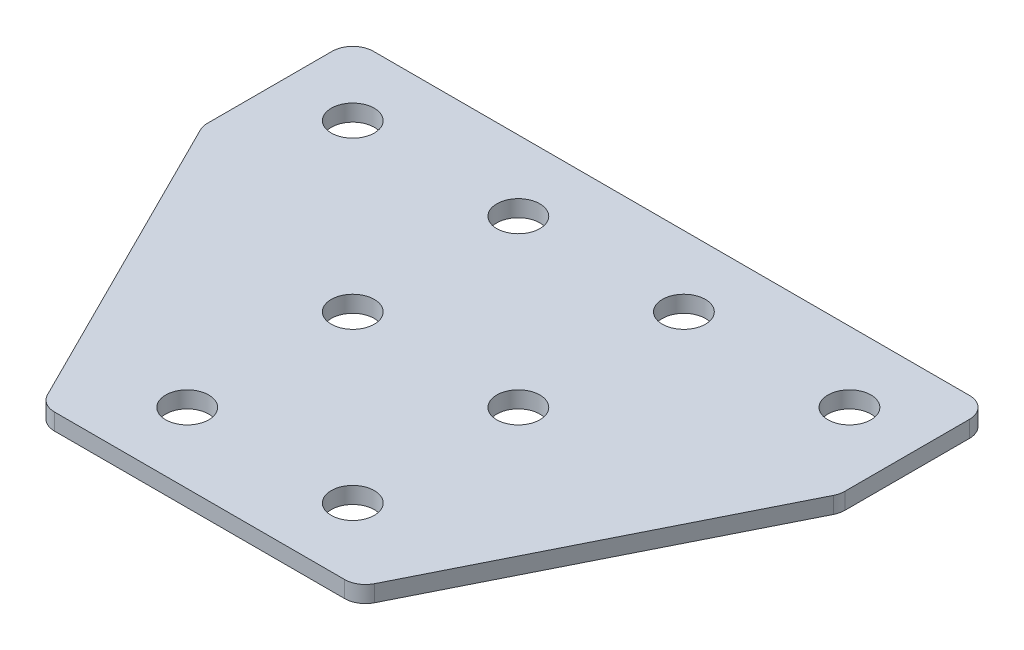
ISO-10303-21;
HEADER;
FILE_DESCRIPTION(('STEP AP214'),'2;1');
FILE_NAME('part.step','',(''),(''),'','','');
FILE_SCHEMA(('AUTOMOTIVE_DESIGN { 1 0 10303 214 1 1 1 1 }'));
ENDSEC;
DATA;
#1=APPLICATION_CONTEXT('core data for automotive mechanical design processes');
#2=APPLICATION_PROTOCOL_DEFINITION('international standard','automotive_design',2000,#1);
#3=PRODUCT_CONTEXT('',#1,'mechanical');
#4=PRODUCT('Part','Part','',(#3));
#5=PRODUCT_RELATED_PRODUCT_CATEGORY('part','',(#4));
#6=PRODUCT_DEFINITION_FORMATION('','',#4);
#7=PRODUCT_DEFINITION_CONTEXT('part definition',#1,'design');
#8=PRODUCT_DEFINITION('design','',#6,#7);
#9=PRODUCT_DEFINITION_SHAPE('','',#8);
#10=(LENGTH_UNIT() NAMED_UNIT(*) SI_UNIT(.MILLI.,.METRE.));
#11=(NAMED_UNIT(*) PLANE_ANGLE_UNIT() SI_UNIT($,.RADIAN.));
#12=(NAMED_UNIT(*) SI_UNIT($,.STERADIAN.) SOLID_ANGLE_UNIT());
#13=UNCERTAINTY_MEASURE_WITH_UNIT(LENGTH_MEASURE(1.E-05),#10,'distance_accuracy_value','');
#14=(GEOMETRIC_REPRESENTATION_CONTEXT(3) GLOBAL_UNCERTAINTY_ASSIGNED_CONTEXT((#13)) GLOBAL_UNIT_ASSIGNED_CONTEXT((#10,
#11,#12)) REPRESENTATION_CONTEXT('',''));
#15=CARTESIAN_POINT('',(0.,0.,0.));
#16=DIRECTION('',(0.,0.,1.));
#17=DIRECTION('',(1.,0.,0.));
#18=AXIS2_PLACEMENT_3D('',#15,#16,#17);
#19=CARTESIAN_POINT('',(-1.45351271942218,1.70798729377475,-21.2540344861804));
#20=DIRECTION('',(0.,-1.,0.));
#21=DIRECTION('',(0.,0.,-1.));
#22=AXIS2_PLACEMENT_3D('',#19,#20,#21);
#23=PLANE('',#22);
#24=DIRECTION('',(1.,0.,0.));
#25=VECTOR('',#24,1.);
#26=CARTESIAN_POINT('',(-19.9535127194222,1.70798729377475,27.2459655138196));
#27=LINE('',#26,#25);
#28=CARTESIAN_POINT('',(-18.9813767644227,1.70798729377475,27.2459655138196));
#29=VERTEX_POINT('',#28);
#30=CARTESIAN_POINT('',(16.0743513255783,1.70798729377475,27.2459655138196));
#31=VERTEX_POINT('',#30);
#32=EDGE_CURVE('E194',#29,#31,#27,.T.);
#33=ORIENTED_EDGE('',*,*,#32,.F.);
#34=CARTESIAN_POINT('',(-18.9813767644227,1.70798729377475,24.7459655138196));
#35=DIRECTION('',(0.,1.,0.));
#36=DIRECTION('',(0.,0.,-1.));
#37=AXIS2_PLACEMENT_3D('',#34,#35,#36);
#38=CIRCLE('',#37,2.5);
#39=CARTESIAN_POINT('',(-21.2174447419224,1.70798729377475,25.8639995025694));
#40=VERTEX_POINT('',#39);
#41=EDGE_CURVE('E154',#40,#29,#38,.T.);
#42=ORIENTED_EDGE('',*,*,#41,.F.);
#43=DIRECTION('',(-0.447213595499957,0.,-0.894427190999917));
#44=VECTOR('',#43,1.);
#45=CARTESIAN_POINT('',(-20.5264617362974,1.70798729377475,27.2459655138196));
#46=LINE('',#45,#44);
#47=CARTESIAN_POINT('',(-39.6895806969219,1.70798729377475,-11.0802724074296));
#48=VERTEX_POINT('',#47);
#49=EDGE_CURVE('E141',#40,#48,#46,.T.);
#50=ORIENTED_EDGE('',*,*,#49,.T.);
#51=CARTESIAN_POINT('',(-37.4535127194221,1.70798729377475,-12.1983063961795));
#52=DIRECTION('',(0.,1.,0.));
#53=DIRECTION('',(0.,0.,-1.));
#54=AXIS2_PLACEMENT_3D('',#51,#52,#53);
#55=CIRCLE('',#54,2.5);
#56=CARTESIAN_POINT('',(-39.9535127194221,1.70798729377475,-12.1983063961795));
#57=VERTEX_POINT('',#56);
#58=EDGE_CURVE('E152',#57,#48,#55,.T.);
#59=ORIENTED_EDGE('',*,*,#58,.F.);
#60=DIRECTION('',(0.,0.,-1.));
#61=VECTOR('',#60,1.);
#62=CARTESIAN_POINT('',(-39.9535127194221,1.70798729377475,-11.60813645243));
#63=LINE('',#62,#61);
#64=CARTESIAN_POINT('',(-39.9535127194221,1.70798729377475,-27.2540344861804));
#65=VERTEX_POINT('',#64);
#66=EDGE_CURVE('E124',#57,#65,#63,.T.);
#67=ORIENTED_EDGE('',*,*,#66,.T.);
#68=CARTESIAN_POINT('',(-37.4535127194221,1.70798729377475,-27.2540344861804));
#69=DIRECTION('',(0.,1.,0.));
#70=DIRECTION('',(0.,0.,-1.));
#71=AXIS2_PLACEMENT_3D('',#68,#69,#70);
#72=CIRCLE('',#71,2.5);
#73=CARTESIAN_POINT('',(-37.4535127194221,1.70798729377475,-29.7540344861804));
#74=VERTEX_POINT('',#73);
#75=EDGE_CURVE('E149',#74,#65,#72,.T.);
#76=ORIENTED_EDGE('',*,*,#75,.F.);
#77=DIRECTION('',(-1.,0.,0.));
#78=VECTOR('',#77,1.);
#79=CARTESIAN_POINT('',(37.0464872805778,1.70798729377475,-29.7540344861805));
#80=LINE('',#79,#78);
#81=CARTESIAN_POINT('',(34.5464872805778,1.70798729377475,-29.7540344861805));
#82=VERTEX_POINT('',#81);
#83=EDGE_CURVE('E191',#82,#74,#80,.T.);
#84=ORIENTED_EDGE('',*,*,#83,.F.);
#85=CARTESIAN_POINT('',(34.5464872805778,1.70798729377475,-27.2540344861805));
#86=DIRECTION('',(0.,-1.,0.));
#87=DIRECTION('',(0.,0.,-1.));
#88=AXIS2_PLACEMENT_3D('',#85,#86,#87);
#89=CIRCLE('',#88,2.5);
#90=CARTESIAN_POINT('',(37.0464872805778,1.70798729377475,-27.2540344861805));
#91=VERTEX_POINT('',#90);
#92=EDGE_CURVE('E215',#82,#91,#89,.T.);
#93=ORIENTED_EDGE('',*,*,#92,.T.);
#94=DIRECTION('',(0.,0.,-1.));
#95=VECTOR('',#94,1.);
#96=CARTESIAN_POINT('',(37.0464872805778,1.70798729377475,-11.60813645243));
#97=LINE('',#96,#95);
#98=CARTESIAN_POINT('',(37.0464872805778,1.70798729377475,-12.1983063961795));
#99=VERTEX_POINT('',#98);
#100=EDGE_CURVE('E188',#99,#91,#97,.T.);
#101=ORIENTED_EDGE('',*,*,#100,.F.);
#102=CARTESIAN_POINT('',(34.5464872805778,1.70798729377475,-12.1983063961795));
#103=DIRECTION('',(0.,-1.,0.));
#104=DIRECTION('',(0.,0.,-1.));
#105=AXIS2_PLACEMENT_3D('',#102,#103,#104);
#106=CIRCLE('',#105,2.5);
#107=CARTESIAN_POINT('',(36.7825552580775,1.70798729377475,-11.0802724074296));
#108=VERTEX_POINT('',#107);
#109=EDGE_CURVE('E31',#99,#108,#106,.T.);
#110=ORIENTED_EDGE('',*,*,#109,.T.);
#111=DIRECTION('',(0.447213595499956,0.,-0.894427190999917));
#112=VECTOR('',#111,1.);
#113=CARTESIAN_POINT('',(17.619436297453,1.70798729377475,27.2459655138196));
#114=LINE('',#113,#112);
#115=CARTESIAN_POINT('',(18.3104193030781,1.70798729377475,25.8639995025694));
#116=VERTEX_POINT('',#115);
#117=EDGE_CURVE('E196',#116,#108,#114,.T.);
#118=ORIENTED_EDGE('',*,*,#117,.F.);
#119=CARTESIAN_POINT('',(16.0743513255783,1.70798729377475,24.7459655138196));
#120=DIRECTION('',(0.,-1.,0.));
#121=DIRECTION('',(0.,0.,-1.));
#122=AXIS2_PLACEMENT_3D('',#119,#120,#121);
#123=CIRCLE('',#122,2.5);
#124=EDGE_CURVE('E218',#116,#31,#123,.T.);
#125=ORIENTED_EDGE('',*,*,#124,.T.);
#126=EDGE_LOOP('',(#33,#42,#50,#59,#67,#76,#84,#93,#101,#110,#118,#125));
#127=FACE_BOUND('',#126,.T.);
#128=CARTESIAN_POINT('',(8.54648728057783,1.70798729377475,18.7459655138196));
#129=DIRECTION('',(0.,1.,0.));
#130=DIRECTION('',(0.,0.,1.));
#131=AXIS2_PLACEMENT_3D('',#128,#129,#130);
#132=CIRCLE('',#131,2.6);
#133=CARTESIAN_POINT('',(8.54648728057783,1.70798729377475,21.3459655138196));
#134=VERTEX_POINT('',#133);
#135=EDGE_CURVE('E164',#134,#134,#132,.T.);
#136=ORIENTED_EDGE('',*,*,#135,.T.);
#137=EDGE_LOOP('',(#136));
#138=FACE_BOUND('',#137,.T.);
#139=CARTESIAN_POINT('',(8.54648728057783,1.70798729377475,-1.2540344861804));
#140=DIRECTION('',(0.,1.,0.));
#141=DIRECTION('',(0.,0.,1.));
#142=AXIS2_PLACEMENT_3D('',#139,#140,#141);
#143=CIRCLE('',#142,2.6);
#144=CARTESIAN_POINT('',(8.54648728057783,1.70798729377475,1.3459655138196));
#145=VERTEX_POINT('',#144);
#146=EDGE_CURVE('E170',#145,#145,#143,.T.);
#147=ORIENTED_EDGE('',*,*,#146,.T.);
#148=EDGE_LOOP('',(#147));
#149=FACE_BOUND('',#148,.T.);
#150=CARTESIAN_POINT('',(28.5464872805778,1.70798729377475,-21.2540344861804));
#151=DIRECTION('',(0.,1.,0.));
#152=DIRECTION('',(0.,0.,1.));
#153=AXIS2_PLACEMENT_3D('',#150,#151,#152);
#154=CIRCLE('',#153,2.6);
#155=CARTESIAN_POINT('',(28.5464872805778,1.70798729377475,-18.6540344861804));
#156=VERTEX_POINT('',#155);
#157=EDGE_CURVE('E176',#156,#156,#154,.T.);
#158=ORIENTED_EDGE('',*,*,#157,.T.);
#159=EDGE_LOOP('',(#158));
#160=FACE_BOUND('',#159,.T.);
#161=CARTESIAN_POINT('',(8.54648728057784,1.70798729377475,-21.2540344861804));
#162=DIRECTION('',(0.,1.,0.));
#163=DIRECTION('',(0.,0.,1.));
#164=AXIS2_PLACEMENT_3D('',#161,#162,#163);
#165=CIRCLE('',#164,2.6);
#166=CARTESIAN_POINT('',(8.54648728057784,1.70798729377475,-18.6540344861804));
#167=VERTEX_POINT('',#166);
#168=EDGE_CURVE('E182',#167,#167,#165,.T.);
#169=ORIENTED_EDGE('',*,*,#168,.T.);
#170=EDGE_LOOP('',(#169));
#171=FACE_BOUND('',#170,.T.);
#172=CARTESIAN_POINT('',(-11.4535127194222,1.70798729377475,18.7459655138196));
#173=DIRECTION('',(0.,-1.,0.));
#174=DIRECTION('',(0.,0.,1.));
#175=AXIS2_PLACEMENT_3D('',#172,#173,#174);
#176=CIRCLE('',#175,2.6);
#177=CARTESIAN_POINT('',(-11.4535127194222,1.70798729377475,21.3459655138196));
#178=VERTEX_POINT('',#177);
#179=EDGE_CURVE('E270',#178,#178,#176,.T.);
#180=ORIENTED_EDGE('',*,*,#179,.F.);
#181=EDGE_LOOP('',(#180));
#182=FACE_BOUND('',#181,.T.);
#183=CARTESIAN_POINT('',(-11.4535127194222,1.70798729377475,-1.2540344861804));
#184=DIRECTION('',(0.,-1.,0.));
#185=DIRECTION('',(0.,0.,1.));
#186=AXIS2_PLACEMENT_3D('',#183,#184,#185);
#187=CIRCLE('',#186,2.6);
#188=CARTESIAN_POINT('',(-11.4535127194222,1.70798729377475,1.3459655138196));
#189=VERTEX_POINT('',#188);
#190=EDGE_CURVE('E264',#189,#189,#187,.T.);
#191=ORIENTED_EDGE('',*,*,#190,.F.);
#192=EDGE_LOOP('',(#191));
#193=FACE_BOUND('',#192,.T.);
#194=CARTESIAN_POINT('',(-31.4535127194222,1.70798729377475,-21.2540344861804));
#195=DIRECTION('',(0.,-1.,0.));
#196=DIRECTION('',(0.,0.,1.));
#197=AXIS2_PLACEMENT_3D('',#194,#195,#196);
#198=CIRCLE('',#197,2.6);
#199=CARTESIAN_POINT('',(-31.4535127194222,1.70798729377475,-18.6540344861804));
#200=VERTEX_POINT('',#199);
#201=EDGE_CURVE('E259',#200,#200,#198,.T.);
#202=ORIENTED_EDGE('',*,*,#201,.F.);
#203=EDGE_LOOP('',(#202));
#204=FACE_BOUND('',#203,.T.);
#205=CARTESIAN_POINT('',(-11.4535127194222,1.70798729377475,-21.2540344861804));
#206=DIRECTION('',(0.,-1.,0.));
#207=DIRECTION('',(0.,0.,1.));
#208=AXIS2_PLACEMENT_3D('',#205,#206,#207);
#209=CIRCLE('',#208,2.6);
#210=CARTESIAN_POINT('',(-11.4535127194222,1.70798729377475,-18.6540344861804));
#211=VERTEX_POINT('',#210);
#212=EDGE_CURVE('E134',#211,#211,#209,.T.);
#213=ORIENTED_EDGE('',*,*,#212,.F.);
#214=EDGE_LOOP('',(#213));
#215=FACE_BOUND('',#214,.T.);
#216=ADVANCED_FACE('F16',(#127,#138,#149,#160,#171,#182,#193,#204,#215),#23,.T.);
#217=CARTESIAN_POINT('',(37.0464872805778,1.70798729377475,-11.60813645243));
#218=DIRECTION('',(1.,0.,0.));
#219=DIRECTION('',(0.,0.,-1.));
#220=AXIS2_PLACEMENT_3D('',#217,#218,#219);
#221=PLANE('',#220);
#222=DIRECTION('',(0.,0.,-1.));
#223=VECTOR('',#222,1.);
#224=CARTESIAN_POINT('',(37.0464872805778,3.70798729377475,-11.60813645243));
#225=LINE('',#224,#223);
#226=CARTESIAN_POINT('',(37.0464872805778,3.70798729377475,-12.1983063961795));
#227=VERTEX_POINT('',#226);
#228=CARTESIAN_POINT('',(37.0464872805778,3.70798729377475,-27.2540344861805));
#229=VERTEX_POINT('',#228);
#230=EDGE_CURVE('E185',#227,#229,#225,.T.);
#231=ORIENTED_EDGE('',*,*,#230,.F.);
#232=DIRECTION('',(0.,1.,0.));
#233=VECTOR('',#232,1.);
#234=CARTESIAN_POINT('',(37.0464872805778,1.70798729377475,-12.1983063961795));
#235=LINE('',#234,#233);
#236=EDGE_CURVE('E24',#227,#99,#235,.F.);
#237=ORIENTED_EDGE('',*,*,#236,.T.);
#238=ORIENTED_EDGE('',*,*,#100,.T.);
#239=DIRECTION('',(0.,1.,0.));
#240=VECTOR('',#239,1.);
#241=CARTESIAN_POINT('',(37.0464872805778,1.70798729377475,-27.2540344861805));
#242=LINE('',#241,#240);
#243=EDGE_CURVE('E225',#91,#229,#242,.T.);
#244=ORIENTED_EDGE('',*,*,#243,.T.);
#245=EDGE_LOOP('',(#231,#237,#238,#244));
#246=FACE_BOUND('',#245,.T.);
#247=ADVANCED_FACE('F230',(#246),#221,.T.);
#248=CARTESIAN_POINT('',(17.619436297453,1.70798729377475,27.2459655138196));
#249=DIRECTION('',(0.894427190999917,0.,0.447213595499956));
#250=DIRECTION('',(0.447213595499956,0.,-0.894427190999917));
#251=AXIS2_PLACEMENT_3D('',#248,#249,#250);
#252=PLANE('',#251);
#253=DIRECTION('',(0.447213595499956,0.,-0.894427190999917));
#254=VECTOR('',#253,1.);
#255=CARTESIAN_POINT('',(17.619436297453,3.70798729377475,27.2459655138196));
#256=LINE('',#255,#254);
#257=CARTESIAN_POINT('',(18.3104193030781,3.70798729377475,25.8639995025694));
#258=VERTEX_POINT('',#257);
#259=CARTESIAN_POINT('',(36.7825552580775,3.70798729377475,-11.0802724074296));
#260=VERTEX_POINT('',#259);
#261=EDGE_CURVE('E192',#258,#260,#256,.T.);
#262=ORIENTED_EDGE('',*,*,#261,.F.);
#263=DIRECTION('',(0.,1.,0.));
#264=VECTOR('',#263,1.);
#265=CARTESIAN_POINT('',(18.3104193030781,1.70798729377475,25.8639995025694));
#266=LINE('',#265,#264);
#267=EDGE_CURVE('E38',#258,#116,#266,.F.);
#268=ORIENTED_EDGE('',*,*,#267,.T.);
#269=ORIENTED_EDGE('',*,*,#117,.T.);
#270=DIRECTION('',(0.,1.,0.));
#271=VECTOR('',#270,1.);
#272=CARTESIAN_POINT('',(36.7825552580775,1.70798729377475,-11.0802724074296));
#273=LINE('',#272,#271);
#274=EDGE_CURVE('E221',#108,#260,#273,.T.);
#275=ORIENTED_EDGE('',*,*,#274,.T.);
#276=EDGE_LOOP('',(#262,#268,#269,#275));
#277=FACE_BOUND('',#276,.T.);
#278=ADVANCED_FACE('F238',(#277),#252,.T.);
#279=CARTESIAN_POINT('',(-19.9535127194222,1.70798729377475,27.2459655138196));
#280=DIRECTION('',(0.,0.,1.));
#281=DIRECTION('',(1.,0.,0.));
#282=AXIS2_PLACEMENT_3D('',#279,#280,#281);
#283=PLANE('',#282);
#284=DIRECTION('',(1.,0.,0.));
#285=VECTOR('',#284,1.);
#286=CARTESIAN_POINT('',(-19.9535127194222,3.70798729377475,27.2459655138196));
#287=LINE('',#286,#285);
#288=CARTESIAN_POINT('',(-18.9813767644227,3.70798729377475,27.2459655138196));
#289=VERTEX_POINT('',#288);
#290=CARTESIAN_POINT('',(16.0743513255783,3.70798729377475,27.2459655138196));
#291=VERTEX_POINT('',#290);
#292=EDGE_CURVE('E203',#289,#291,#287,.T.);
#293=ORIENTED_EDGE('',*,*,#292,.F.);
#294=DIRECTION('',(0.,1.,0.));
#295=VECTOR('',#294,1.);
#296=CARTESIAN_POINT('',(-18.9813767644227,1.70798729377475,27.2459655138196));
#297=LINE('',#296,#295);
#298=EDGE_CURVE('E146',#29,#289,#297,.T.);
#299=ORIENTED_EDGE('',*,*,#298,.F.);
#300=ORIENTED_EDGE('',*,*,#32,.T.);
#301=DIRECTION('',(0.,1.,0.));
#302=VECTOR('',#301,1.);
#303=CARTESIAN_POINT('',(16.0743513255783,1.70798729377475,27.2459655138196));
#304=LINE('',#303,#302);
#305=EDGE_CURVE('E212',#31,#291,#304,.T.);
#306=ORIENTED_EDGE('',*,*,#305,.T.);
#307=EDGE_LOOP('',(#293,#299,#300,#306));
#308=FACE_BOUND('',#307,.T.);
#309=ADVANCED_FACE('F246',(#308),#283,.T.);
#310=CARTESIAN_POINT('',(37.0464872805778,1.70798729377475,-29.7540344861805));
#311=DIRECTION('',(0.,0.,-1.));
#312=DIRECTION('',(-1.,0.,0.));
#313=AXIS2_PLACEMENT_3D('',#310,#311,#312);
#314=PLANE('',#313);
#315=ORIENTED_EDGE('',*,*,#83,.T.);
#316=DIRECTION('',(0.,1.,0.));
#317=VECTOR('',#316,1.);
#318=CARTESIAN_POINT('',(-37.4535127194221,1.70798729377475,-29.7540344861804));
#319=LINE('',#318,#317);
#320=CARTESIAN_POINT('',(-37.4535127194221,3.70798729377475,-29.7540344861804));
#321=VERTEX_POINT('',#320);
#322=EDGE_CURVE('E126',#321,#74,#319,.F.);
#323=ORIENTED_EDGE('',*,*,#322,.F.);
#324=DIRECTION('',(-1.,0.,0.));
#325=VECTOR('',#324,1.);
#326=CARTESIAN_POINT('',(37.0464872805778,3.70798729377475,-29.7540344861805));
#327=LINE('',#326,#325);
#328=CARTESIAN_POINT('',(34.5464872805778,3.70798729377475,-29.7540344861805));
#329=VERTEX_POINT('',#328);
#330=EDGE_CURVE('E201',#329,#321,#327,.T.);
#331=ORIENTED_EDGE('',*,*,#330,.F.);
#332=DIRECTION('',(0.,1.,0.));
#333=VECTOR('',#332,1.);
#334=CARTESIAN_POINT('',(34.5464872805778,1.70798729377475,-29.7540344861805));
#335=LINE('',#334,#333);
#336=EDGE_CURVE('E10',#329,#82,#335,.F.);
#337=ORIENTED_EDGE('',*,*,#336,.T.);
#338=EDGE_LOOP('',(#315,#323,#331,#337));
#339=FACE_BOUND('',#338,.T.);
#340=ADVANCED_FACE('F300',(#339),#314,.T.);
#341=CARTESIAN_POINT('',(-1.45351271942218,3.70798729377475,-21.2540344861804));
#342=DIRECTION('',(0.,-1.,0.));
#343=DIRECTION('',(0.,0.,-1.));
#344=AXIS2_PLACEMENT_3D('',#341,#342,#343);
#345=PLANE('',#344);
#346=CARTESIAN_POINT('',(8.54648728057783,3.70798729377475,18.7459655138196));
#347=DIRECTION('',(0.,1.,0.));
#348=DIRECTION('',(0.,0.,1.));
#349=AXIS2_PLACEMENT_3D('',#346,#347,#348);
#350=CIRCLE('',#349,2.6);
#351=CARTESIAN_POINT('',(8.54648728057783,3.70798729377475,21.3459655138196));
#352=VERTEX_POINT('',#351);
#353=EDGE_CURVE('E163',#352,#352,#350,.T.);
#354=ORIENTED_EDGE('',*,*,#353,.F.);
#355=EDGE_LOOP('',(#354));
#356=FACE_BOUND('',#355,.T.);
#357=CARTESIAN_POINT('',(8.54648728057783,3.70798729377475,-1.2540344861804));
#358=DIRECTION('',(0.,1.,0.));
#359=DIRECTION('',(0.,0.,1.));
#360=AXIS2_PLACEMENT_3D('',#357,#358,#359);
#361=CIRCLE('',#360,2.6);
#362=CARTESIAN_POINT('',(8.54648728057783,3.70798729377475,1.3459655138196));
#363=VERTEX_POINT('',#362);
#364=EDGE_CURVE('E167',#363,#363,#361,.T.);
#365=ORIENTED_EDGE('',*,*,#364,.F.);
#366=EDGE_LOOP('',(#365));
#367=FACE_BOUND('',#366,.T.);
#368=CARTESIAN_POINT('',(28.5464872805778,3.70798729377475,-21.2540344861804));
#369=DIRECTION('',(0.,1.,0.));
#370=DIRECTION('',(0.,0.,1.));
#371=AXIS2_PLACEMENT_3D('',#368,#369,#370);
#372=CIRCLE('',#371,2.6);
#373=CARTESIAN_POINT('',(28.5464872805778,3.70798729377475,-18.6540344861804));
#374=VERTEX_POINT('',#373);
#375=EDGE_CURVE('E173',#374,#374,#372,.T.);
#376=ORIENTED_EDGE('',*,*,#375,.F.);
#377=EDGE_LOOP('',(#376));
#378=FACE_BOUND('',#377,.T.);
#379=CARTESIAN_POINT('',(8.54648728057784,3.70798729377475,-21.2540344861804));
#380=DIRECTION('',(0.,1.,0.));
#381=DIRECTION('',(0.,0.,1.));
#382=AXIS2_PLACEMENT_3D('',#379,#380,#381);
#383=CIRCLE('',#382,2.6);
#384=CARTESIAN_POINT('',(8.54648728057784,3.70798729377475,-18.6540344861804));
#385=VERTEX_POINT('',#384);
#386=EDGE_CURVE('E179',#385,#385,#383,.T.);
#387=ORIENTED_EDGE('',*,*,#386,.F.);
#388=EDGE_LOOP('',(#387));
#389=FACE_BOUND('',#388,.T.);
#390=ORIENTED_EDGE('',*,*,#330,.T.);
#391=CARTESIAN_POINT('',(-37.4535127194221,3.70798729377475,-27.2540344861804));
#392=DIRECTION('',(0.,1.,0.));
#393=DIRECTION('',(0.,0.,-1.));
#394=AXIS2_PLACEMENT_3D('',#391,#392,#393);
#395=CIRCLE('',#394,2.5);
#396=CARTESIAN_POINT('',(-39.9535127194221,3.70798729377475,-27.2540344861804));
#397=VERTEX_POINT('',#396);
#398=EDGE_CURVE('E117',#397,#321,#395,.F.);
#399=ORIENTED_EDGE('',*,*,#398,.F.);
#400=DIRECTION('',(0.,0.,-1.));
#401=VECTOR('',#400,1.);
#402=CARTESIAN_POINT('',(-39.9535127194221,3.70798729377475,-11.60813645243));
#403=LINE('',#402,#401);
#404=CARTESIAN_POINT('',(-39.9535127194221,3.70798729377475,-12.1983063961795));
#405=VERTEX_POINT('',#404);
#406=EDGE_CURVE('E122',#405,#397,#403,.T.);
#407=ORIENTED_EDGE('',*,*,#406,.F.);
#408=CARTESIAN_POINT('',(-37.4535127194221,3.70798729377475,-12.1983063961795));
#409=DIRECTION('',(0.,1.,0.));
#410=DIRECTION('',(0.,0.,-1.));
#411=AXIS2_PLACEMENT_3D('',#408,#409,#410);
#412=CIRCLE('',#411,2.5);
#413=CARTESIAN_POINT('',(-39.6895806969219,3.70798729377475,-11.0802724074296));
#414=VERTEX_POINT('',#413);
#415=EDGE_CURVE('E105',#414,#405,#412,.F.);
#416=ORIENTED_EDGE('',*,*,#415,.F.);
#417=DIRECTION('',(-0.447213595499957,0.,-0.894427190999917));
#418=VECTOR('',#417,1.);
#419=CARTESIAN_POINT('',(-20.5264617362974,3.70798729377475,27.2459655138196));
#420=LINE('',#419,#418);
#421=CARTESIAN_POINT('',(-21.2174447419224,3.70798729377475,25.8639995025694));
#422=VERTEX_POINT('',#421);
#423=EDGE_CURVE('E133',#422,#414,#420,.T.);
#424=ORIENTED_EDGE('',*,*,#423,.F.);
#425=CARTESIAN_POINT('',(-18.9813767644227,3.70798729377475,24.7459655138196));
#426=DIRECTION('',(0.,1.,0.));
#427=DIRECTION('',(0.,0.,-1.));
#428=AXIS2_PLACEMENT_3D('',#425,#426,#427);
#429=CIRCLE('',#428,2.5);
#430=EDGE_CURVE('E116',#289,#422,#429,.F.);
#431=ORIENTED_EDGE('',*,*,#430,.F.);
#432=ORIENTED_EDGE('',*,*,#292,.T.);
#433=CARTESIAN_POINT('',(16.0743513255783,3.70798729377475,24.7459655138196));
#434=DIRECTION('',(0.,-1.,0.));
#435=DIRECTION('',(0.,0.,-1.));
#436=AXIS2_PLACEMENT_3D('',#433,#434,#435);
#437=CIRCLE('',#436,2.5);
#438=EDGE_CURVE('E210',#291,#258,#437,.F.);
#439=ORIENTED_EDGE('',*,*,#438,.T.);
#440=ORIENTED_EDGE('',*,*,#261,.T.);
#441=CARTESIAN_POINT('',(34.5464872805778,3.70798729377475,-12.1983063961795));
#442=DIRECTION('',(0.,-1.,0.));
#443=DIRECTION('',(0.,0.,-1.));
#444=AXIS2_PLACEMENT_3D('',#441,#442,#443);
#445=CIRCLE('',#444,2.5);
#446=EDGE_CURVE('E208',#260,#227,#445,.F.);
#447=ORIENTED_EDGE('',*,*,#446,.T.);
#448=ORIENTED_EDGE('',*,*,#230,.T.);
#449=CARTESIAN_POINT('',(34.5464872805778,3.70798729377475,-27.2540344861805));
#450=DIRECTION('',(0.,-1.,0.));
#451=DIRECTION('',(0.,0.,-1.));
#452=AXIS2_PLACEMENT_3D('',#449,#450,#451);
#453=CIRCLE('',#452,2.5);
#454=EDGE_CURVE('E198',#229,#329,#453,.F.);
#455=ORIENTED_EDGE('',*,*,#454,.T.);
#456=EDGE_LOOP('',(#390,#399,#407,#416,#424,#431,#432,#439,#440,#447,#448,#455));
#457=FACE_BOUND('',#456,.T.);
#458=CARTESIAN_POINT('',(-11.4535127194222,3.70798729377475,18.7459655138196));
#459=DIRECTION('',(0.,-1.,0.));
#460=DIRECTION('',(0.,0.,1.));
#461=AXIS2_PLACEMENT_3D('',#458,#459,#460);
#462=CIRCLE('',#461,2.6);
#463=CARTESIAN_POINT('',(-11.4535127194222,3.70798729377475,21.3459655138196));
#464=VERTEX_POINT('',#463);
#465=EDGE_CURVE('E273',#464,#464,#462,.T.);
#466=ORIENTED_EDGE('',*,*,#465,.T.);
#467=EDGE_LOOP('',(#466));
#468=FACE_BOUND('',#467,.T.);
#469=CARTESIAN_POINT('',(-11.4535127194222,3.70798729377475,-1.2540344861804));
#470=DIRECTION('',(0.,-1.,0.));
#471=DIRECTION('',(0.,0.,1.));
#472=AXIS2_PLACEMENT_3D('',#469,#470,#471);
#473=CIRCLE('',#472,2.6);
#474=CARTESIAN_POINT('',(-11.4535127194222,3.70798729377475,1.3459655138196));
#475=VERTEX_POINT('',#474);
#476=EDGE_CURVE('E267',#475,#475,#473,.T.);
#477=ORIENTED_EDGE('',*,*,#476,.T.);
#478=EDGE_LOOP('',(#477));
#479=FACE_BOUND('',#478,.T.);
#480=CARTESIAN_POINT('',(-31.4535127194222,3.70798729377475,-21.2540344861804));
#481=DIRECTION('',(0.,-1.,0.));
#482=DIRECTION('',(0.,0.,1.));
#483=AXIS2_PLACEMENT_3D('',#480,#481,#482);
#484=CIRCLE('',#483,2.6);
#485=CARTESIAN_POINT('',(-31.4535127194222,3.70798729377475,-18.6540344861804));
#486=VERTEX_POINT('',#485);
#487=EDGE_CURVE('E261',#486,#486,#484,.T.);
#488=ORIENTED_EDGE('',*,*,#487,.T.);
#489=EDGE_LOOP('',(#488));
#490=FACE_BOUND('',#489,.T.);
#491=CARTESIAN_POINT('',(-11.4535127194222,3.70798729377475,-21.2540344861804));
#492=DIRECTION('',(0.,-1.,0.));
#493=DIRECTION('',(0.,0.,1.));
#494=AXIS2_PLACEMENT_3D('',#491,#492,#493);
#495=CIRCLE('',#494,2.6);
#496=CARTESIAN_POINT('',(-11.4535127194222,3.70798729377475,-18.6540344861804));
#497=VERTEX_POINT('',#496);
#498=EDGE_CURVE('E138',#497,#497,#495,.T.);
#499=ORIENTED_EDGE('',*,*,#498,.T.);
#500=EDGE_LOOP('',(#499));
#501=FACE_BOUND('',#500,.T.);
#502=ADVANCED_FACE('F129',(#356,#367,#378,#389,#457,#468,#479,#490,#501),#345,.F.);
#503=CARTESIAN_POINT('',(16.0743513255783,1.70798729377475,24.7459655138196));
#504=DIRECTION('',(0.,1.,0.));
#505=DIRECTION('',(0.,0.,1.));
#506=AXIS2_PLACEMENT_3D('',#503,#504,#505);
#507=CYLINDRICAL_SURFACE('',#506,2.5);
#508=ORIENTED_EDGE('',*,*,#124,.F.);
#509=ORIENTED_EDGE('',*,*,#267,.F.);
#510=ORIENTED_EDGE('',*,*,#438,.F.);
#511=ORIENTED_EDGE('',*,*,#305,.F.);
#512=EDGE_LOOP('',(#508,#509,#510,#511));
#513=FACE_BOUND('',#512,.T.);
#514=ADVANCED_FACE('F244',(#513),#507,.T.);
#515=CARTESIAN_POINT('',(34.5464872805778,1.70798729377475,-12.1983063961795));
#516=DIRECTION('',(0.,1.,0.));
#517=DIRECTION('',(0.,0.,1.));
#518=AXIS2_PLACEMENT_3D('',#515,#516,#517);
#519=CYLINDRICAL_SURFACE('',#518,2.5);
#520=ORIENTED_EDGE('',*,*,#109,.F.);
#521=ORIENTED_EDGE('',*,*,#236,.F.);
#522=ORIENTED_EDGE('',*,*,#446,.F.);
#523=ORIENTED_EDGE('',*,*,#274,.F.);
#524=EDGE_LOOP('',(#520,#521,#522,#523));
#525=FACE_BOUND('',#524,.T.);
#526=ADVANCED_FACE('F237',(#525),#519,.T.);
#527=CARTESIAN_POINT('',(34.5464872805778,1.70798729377475,-27.2540344861805));
#528=DIRECTION('',(0.,1.,0.));
#529=DIRECTION('',(0.,0.,1.));
#530=AXIS2_PLACEMENT_3D('',#527,#528,#529);
#531=CYLINDRICAL_SURFACE('',#530,2.5);
#532=ORIENTED_EDGE('',*,*,#92,.F.);
#533=ORIENTED_EDGE('',*,*,#336,.F.);
#534=ORIENTED_EDGE('',*,*,#454,.F.);
#535=ORIENTED_EDGE('',*,*,#243,.F.);
#536=EDGE_LOOP('',(#532,#533,#534,#535));
#537=FACE_BOUND('',#536,.T.);
#538=ADVANCED_FACE('F18',(#537),#531,.T.);
#539=CARTESIAN_POINT('',(8.54648728057784,1.70798729377475,-21.2540344861804));
#540=DIRECTION('',(0.,1.,0.));
#541=DIRECTION('',(0.,0.,1.));
#542=AXIS2_PLACEMENT_3D('',#539,#540,#541);
#543=CYLINDRICAL_SURFACE('',#542,2.6);
#544=ORIENTED_EDGE('',*,*,#168,.F.);
#545=EDGE_LOOP('',(#544));
#546=FACE_BOUND('',#545,.T.);
#547=ORIENTED_EDGE('',*,*,#386,.T.);
#548=EDGE_LOOP('',(#547));
#549=FACE_BOUND('',#548,.T.);
#550=ADVANCED_FACE('F318',(#546,#549),#543,.F.);
#551=CARTESIAN_POINT('',(28.5464872805778,1.70798729377475,-21.2540344861804));
#552=DIRECTION('',(0.,1.,0.));
#553=DIRECTION('',(0.,0.,1.));
#554=AXIS2_PLACEMENT_3D('',#551,#552,#553);
#555=CYLINDRICAL_SURFACE('',#554,2.6);
#556=ORIENTED_EDGE('',*,*,#157,.F.);
#557=EDGE_LOOP('',(#556));
#558=FACE_BOUND('',#557,.T.);
#559=ORIENTED_EDGE('',*,*,#375,.T.);
#560=EDGE_LOOP('',(#559));
#561=FACE_BOUND('',#560,.T.);
#562=ADVANCED_FACE('F323',(#558,#561),#555,.F.);
#563=CARTESIAN_POINT('',(8.54648728057783,1.70798729377475,-1.2540344861804));
#564=DIRECTION('',(0.,1.,0.));
#565=DIRECTION('',(0.,0.,1.));
#566=AXIS2_PLACEMENT_3D('',#563,#564,#565);
#567=CYLINDRICAL_SURFACE('',#566,2.6);
#568=ORIENTED_EDGE('',*,*,#146,.F.);
#569=EDGE_LOOP('',(#568));
#570=FACE_BOUND('',#569,.T.);
#571=ORIENTED_EDGE('',*,*,#364,.T.);
#572=EDGE_LOOP('',(#571));
#573=FACE_BOUND('',#572,.T.);
#574=ADVANCED_FACE('F341',(#570,#573),#567,.F.);
#575=CARTESIAN_POINT('',(8.54648728057783,1.70798729377475,18.7459655138196));
#576=DIRECTION('',(0.,1.,0.));
#577=DIRECTION('',(0.,0.,1.));
#578=AXIS2_PLACEMENT_3D('',#575,#576,#577);
#579=CYLINDRICAL_SURFACE('',#578,2.6);
#580=ORIENTED_EDGE('',*,*,#135,.F.);
#581=EDGE_LOOP('',(#580));
#582=FACE_BOUND('',#581,.T.);
#583=ORIENTED_EDGE('',*,*,#353,.T.);
#584=EDGE_LOOP('',(#583));
#585=FACE_BOUND('',#584,.T.);
#586=ADVANCED_FACE('F338',(#582,#585),#579,.F.);
#587=CARTESIAN_POINT('',(-39.9535127194221,1.70798729377475,-11.60813645243));
#588=DIRECTION('',(-1.,0.,0.));
#589=DIRECTION('',(0.,0.,-1.));
#590=AXIS2_PLACEMENT_3D('',#587,#588,#589);
#591=PLANE('',#590);
#592=ORIENTED_EDGE('',*,*,#406,.T.);
#593=DIRECTION('',(0.,1.,0.));
#594=VECTOR('',#593,1.);
#595=CARTESIAN_POINT('',(-39.9535127194221,1.70798729377475,-27.2540344861804));
#596=LINE('',#595,#594);
#597=EDGE_CURVE('E127',#65,#397,#596,.T.);
#598=ORIENTED_EDGE('',*,*,#597,.F.);
#599=ORIENTED_EDGE('',*,*,#66,.F.);
#600=DIRECTION('',(0.,1.,0.));
#601=VECTOR('',#600,1.);
#602=CARTESIAN_POINT('',(-39.9535127194221,1.70798729377475,-12.1983063961795));
#603=LINE('',#602,#601);
#604=EDGE_CURVE('E109',#405,#57,#603,.F.);
#605=ORIENTED_EDGE('',*,*,#604,.F.);
#606=EDGE_LOOP('',(#592,#598,#599,#605));
#607=FACE_BOUND('',#606,.T.);
#608=ADVANCED_FACE('F121',(#607),#591,.T.);
#609=CARTESIAN_POINT('',(-20.5264617362974,1.70798729377475,27.2459655138196));
#610=DIRECTION('',(-0.894427190999917,0.,0.447213595499957));
#611=DIRECTION('',(-0.447213595499957,0.,-0.894427190999917));
#612=AXIS2_PLACEMENT_3D('',#609,#610,#611);
#613=PLANE('',#612);
#614=ORIENTED_EDGE('',*,*,#423,.T.);
#615=DIRECTION('',(0.,1.,0.));
#616=VECTOR('',#615,1.);
#617=CARTESIAN_POINT('',(-39.6895806969219,1.70798729377475,-11.0802724074296));
#618=LINE('',#617,#616);
#619=EDGE_CURVE('E111',#48,#414,#618,.T.);
#620=ORIENTED_EDGE('',*,*,#619,.F.);
#621=ORIENTED_EDGE('',*,*,#49,.F.);
#622=DIRECTION('',(0.,1.,0.));
#623=VECTOR('',#622,1.);
#624=CARTESIAN_POINT('',(-21.2174447419224,1.70798729377475,25.8639995025694));
#625=LINE('',#624,#623);
#626=EDGE_CURVE('E158',#422,#40,#625,.F.);
#627=ORIENTED_EDGE('',*,*,#626,.F.);
#628=EDGE_LOOP('',(#614,#620,#621,#627));
#629=FACE_BOUND('',#628,.T.);
#630=ADVANCED_FACE('F255',(#629),#613,.T.);
#631=CARTESIAN_POINT('',(-18.9813767644227,1.70798729377475,24.7459655138196));
#632=DIRECTION('',(0.,1.,0.));
#633=DIRECTION('',(0.,0.,1.));
#634=AXIS2_PLACEMENT_3D('',#631,#632,#633);
#635=CYLINDRICAL_SURFACE('',#634,2.5);
#636=ORIENTED_EDGE('',*,*,#41,.T.);
#637=ORIENTED_EDGE('',*,*,#298,.T.);
#638=ORIENTED_EDGE('',*,*,#430,.T.);
#639=ORIENTED_EDGE('',*,*,#626,.T.);
#640=EDGE_LOOP('',(#636,#637,#638,#639));
#641=FACE_BOUND('',#640,.T.);
#642=ADVANCED_FACE('F252',(#641),#635,.T.);
#643=CARTESIAN_POINT('',(-37.4535127194221,1.70798729377475,-12.1983063961795));
#644=DIRECTION('',(0.,1.,0.));
#645=DIRECTION('',(0.,0.,1.));
#646=AXIS2_PLACEMENT_3D('',#643,#644,#645);
#647=CYLINDRICAL_SURFACE('',#646,2.5);
#648=ORIENTED_EDGE('',*,*,#58,.T.);
#649=ORIENTED_EDGE('',*,*,#619,.T.);
#650=ORIENTED_EDGE('',*,*,#415,.T.);
#651=ORIENTED_EDGE('',*,*,#604,.T.);
#652=EDGE_LOOP('',(#648,#649,#650,#651));
#653=FACE_BOUND('',#652,.T.);
#654=ADVANCED_FACE('F108',(#653),#647,.T.);
#655=CARTESIAN_POINT('',(-37.4535127194221,1.70798729377475,-27.2540344861804));
#656=DIRECTION('',(0.,1.,0.));
#657=DIRECTION('',(0.,0.,1.));
#658=AXIS2_PLACEMENT_3D('',#655,#656,#657);
#659=CYLINDRICAL_SURFACE('',#658,2.5);
#660=ORIENTED_EDGE('',*,*,#75,.T.);
#661=ORIENTED_EDGE('',*,*,#597,.T.);
#662=ORIENTED_EDGE('',*,*,#398,.T.);
#663=ORIENTED_EDGE('',*,*,#322,.T.);
#664=EDGE_LOOP('',(#660,#661,#662,#663));
#665=FACE_BOUND('',#664,.T.);
#666=ADVANCED_FACE('F295',(#665),#659,.T.);
#667=CARTESIAN_POINT('',(-11.4535127194222,1.70798729377475,-21.2540344861804));
#668=DIRECTION('',(0.,1.,0.));
#669=DIRECTION('',(0.,0.,1.));
#670=AXIS2_PLACEMENT_3D('',#667,#668,#669);
#671=CYLINDRICAL_SURFACE('',#670,2.6);
#672=ORIENTED_EDGE('',*,*,#212,.T.);
#673=EDGE_LOOP('',(#672));
#674=FACE_BOUND('',#673,.T.);
#675=ORIENTED_EDGE('',*,*,#498,.F.);
#676=EDGE_LOOP('',(#675));
#677=FACE_BOUND('',#676,.T.);
#678=ADVANCED_FACE('F291',(#674,#677),#671,.F.);
#679=CARTESIAN_POINT('',(-31.4535127194222,1.70798729377475,-21.2540344861804));
#680=DIRECTION('',(0.,1.,0.));
#681=DIRECTION('',(0.,0.,1.));
#682=AXIS2_PLACEMENT_3D('',#679,#680,#681);
#683=CYLINDRICAL_SURFACE('',#682,2.6);
#684=ORIENTED_EDGE('',*,*,#201,.T.);
#685=EDGE_LOOP('',(#684));
#686=FACE_BOUND('',#685,.T.);
#687=ORIENTED_EDGE('',*,*,#487,.F.);
#688=EDGE_LOOP('',(#687));
#689=FACE_BOUND('',#688,.T.);
#690=ADVANCED_FACE('F294',(#686,#689),#683,.F.);
#691=CARTESIAN_POINT('',(-11.4535127194222,1.70798729377475,-1.2540344861804));
#692=DIRECTION('',(0.,1.,0.));
#693=DIRECTION('',(0.,0.,1.));
#694=AXIS2_PLACEMENT_3D('',#691,#692,#693);
#695=CYLINDRICAL_SURFACE('',#694,2.6);
#696=ORIENTED_EDGE('',*,*,#190,.T.);
#697=EDGE_LOOP('',(#696));
#698=FACE_BOUND('',#697,.T.);
#699=ORIENTED_EDGE('',*,*,#476,.F.);
#700=EDGE_LOOP('',(#699));
#701=FACE_BOUND('',#700,.T.);
#702=ADVANCED_FACE('F456',(#698,#701),#695,.F.);
#703=CARTESIAN_POINT('',(-11.4535127194222,1.70798729377475,18.7459655138196));
#704=DIRECTION('',(0.,1.,0.));
#705=DIRECTION('',(0.,0.,1.));
#706=AXIS2_PLACEMENT_3D('',#703,#704,#705);
#707=CYLINDRICAL_SURFACE('',#706,2.6);
#708=ORIENTED_EDGE('',*,*,#179,.T.);
#709=EDGE_LOOP('',(#708));
#710=FACE_BOUND('',#709,.T.);
#711=ORIENTED_EDGE('',*,*,#465,.F.);
#712=EDGE_LOOP('',(#711));
#713=FACE_BOUND('',#712,.T.);
#714=ADVANCED_FACE('F279',(#710,#713),#707,.F.);
#715=CLOSED_SHELL('',(#216,#247,#278,#309,#340,#502,#514,#526,#538,#550,#562,#574,#586,#608,
#630,#642,#654,#666,#678,#690,#702,#714));
#716=MANIFOLD_SOLID_BREP('B1',#715);
#717=ADVANCED_BREP_SHAPE_REPRESENTATION('',(#18,#716),#14);
#718=SHAPE_DEFINITION_REPRESENTATION(#9,#717);
ENDSEC;
END-ISO-10303-21;
